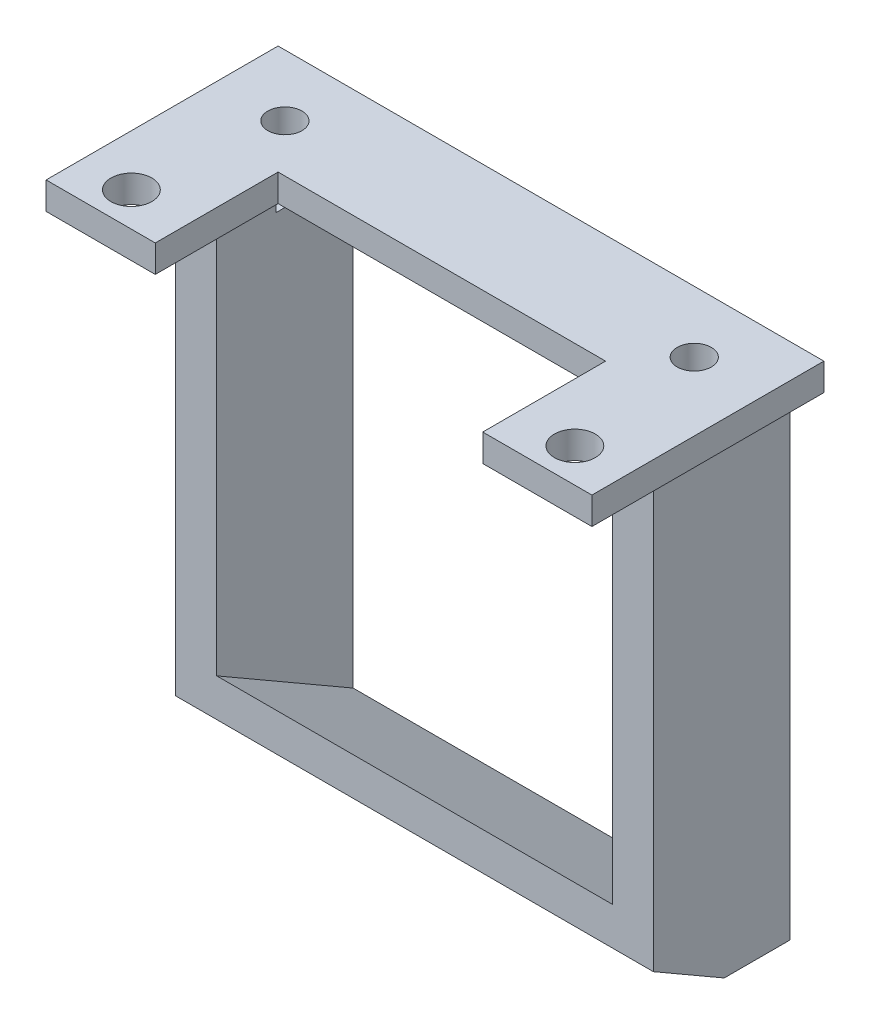
ISO-10303-21;
HEADER;
FILE_DESCRIPTION(('STEP AP214'),'2;1');
FILE_NAME('part.step','',(''),(''),'','','');
FILE_SCHEMA(('AUTOMOTIVE_DESIGN { 1 0 10303 214 1 1 1 1 }'));
ENDSEC;
DATA;
#1=APPLICATION_CONTEXT('core data for automotive mechanical design processes');
#2=APPLICATION_PROTOCOL_DEFINITION('international standard','automotive_design',2000,#1);
#3=PRODUCT_CONTEXT('',#1,'mechanical');
#4=PRODUCT('Part','Part','',(#3));
#5=PRODUCT_RELATED_PRODUCT_CATEGORY('part','',(#4));
#6=PRODUCT_DEFINITION_FORMATION('','',#4);
#7=PRODUCT_DEFINITION_CONTEXT('part definition',#1,'design');
#8=PRODUCT_DEFINITION('design','',#6,#7);
#9=PRODUCT_DEFINITION_SHAPE('','',#8);
#10=(LENGTH_UNIT() NAMED_UNIT(*) SI_UNIT(.MILLI.,.METRE.));
#11=(NAMED_UNIT(*) PLANE_ANGLE_UNIT() SI_UNIT($,.RADIAN.));
#12=(NAMED_UNIT(*) SI_UNIT($,.STERADIAN.) SOLID_ANGLE_UNIT());
#13=UNCERTAINTY_MEASURE_WITH_UNIT(LENGTH_MEASURE(1.E-05),#10,'distance_accuracy_value','');
#14=(GEOMETRIC_REPRESENTATION_CONTEXT(3) GLOBAL_UNCERTAINTY_ASSIGNED_CONTEXT((#13)) GLOBAL_UNIT_ASSIGNED_CONTEXT((#10,
#11,#12)) REPRESENTATION_CONTEXT('',''));
#15=CARTESIAN_POINT('',(0.,0.,0.));
#16=DIRECTION('',(0.,0.,1.));
#17=DIRECTION('',(1.,0.,0.));
#18=AXIS2_PLACEMENT_3D('',#15,#16,#17);
#19=CARTESIAN_POINT('',(0.,-2.,0.));
#20=DIRECTION('',(0.,1.,0.));
#21=DIRECTION('',(0.,0.,1.));
#22=AXIS2_PLACEMENT_3D('',#19,#20,#21);
#23=PLANE('',#22);
#24=CARTESIAN_POINT('',(-17.9639658488218,-2.,0.98592666671358));
#25=DIRECTION('',(0.,1.,0.));
#26=DIRECTION('',(0.,0.,1.));
#27=AXIS2_PLACEMENT_3D('',#24,#25,#26);
#28=CIRCLE('',#27,1.5);
#29=CARTESIAN_POINT('',(-17.9639658488218,-2.,2.48592666671358));
#30=VERTEX_POINT('',#29);
#31=EDGE_CURVE('E221',#30,#30,#28,.T.);
#32=ORIENTED_EDGE('',*,*,#31,.T.);
#33=EDGE_LOOP('',(#32));
#34=FACE_BOUND('',#33,.T.);
#35=CARTESIAN_POINT('',(14.5360341511782,-2.,0.985926666713577));
#36=DIRECTION('',(0.,1.,0.));
#37=DIRECTION('',(0.,0.,1.));
#38=AXIS2_PLACEMENT_3D('',#35,#36,#37);
#39=CIRCLE('',#38,1.5);
#40=CARTESIAN_POINT('',(14.5360341511782,-2.,2.48592666671358));
#41=VERTEX_POINT('',#40);
#42=EDGE_CURVE('E218',#41,#41,#39,.T.);
#43=ORIENTED_EDGE('',*,*,#42,.T.);
#44=EDGE_LOOP('',(#43));
#45=FACE_BOUND('',#44,.T.);
#46=DIRECTION('',(0.,0.,-1.));
#47=VECTOR('',#46,1.);
#48=CARTESIAN_POINT('',(12.7860341511782,-2.,-13.5140733332864));
#49=LINE('',#48,#47);
#50=CARTESIAN_POINT('',(12.7860341511782,-2.,-10.1597172570254));
#51=VERTEX_POINT('',#50);
#52=CARTESIAN_POINT('',(12.7860341511782,-2.,-13.5140733332864));
#53=VERTEX_POINT('',#52);
#54=EDGE_CURVE('E217',#51,#53,#49,.T.);
#55=ORIENTED_EDGE('',*,*,#54,.F.);
#56=CARTESIAN_POINT('',(13.2860341511782,-2.,-9.01407333328642));
#57=DIRECTION('',(0.,1.,0.));
#58=DIRECTION('',(0.,0.,1.));
#59=AXIS2_PLACEMENT_3D('',#56,#57,#58);
#60=CIRCLE('',#59,1.25);
#61=CARTESIAN_POINT('',(12.7860341511782,-2.,-7.86842940954746));
#62=VERTEX_POINT('',#61);
#63=EDGE_CURVE('E211',#51,#62,#60,.T.);
#64=ORIENTED_EDGE('',*,*,#63,.T.);
#65=CARTESIAN_POINT('',(12.7860341511782,-2.,-3.51407333328642));
#66=VERTEX_POINT('',#65);
#67=EDGE_CURVE('E207',#66,#62,#49,.T.);
#68=ORIENTED_EDGE('',*,*,#67,.F.);
#69=DIRECTION('',(-1.,0.,0.));
#70=VECTOR('',#69,1.);
#71=CARTESIAN_POINT('',(15.7860341511782,-2.,-3.51407333328642));
#72=LINE('',#71,#70);
#73=CARTESIAN_POINT('',(15.7860341511782,-2.,-3.51407333328642));
#74=VERTEX_POINT('',#73);
#75=EDGE_CURVE('E280',#74,#66,#72,.T.);
#76=ORIENTED_EDGE('',*,*,#75,.F.);
#77=DIRECTION('',(0.,0.,1.));
#78=VECTOR('',#77,1.);
#79=CARTESIAN_POINT('',(15.7860341511782,-2.,-13.5140733332864));
#80=LINE('',#79,#78);
#81=CARTESIAN_POINT('',(15.7860341511782,-2.,-13.5140733332864));
#82=VERTEX_POINT('',#81);
#83=EDGE_CURVE('E271',#82,#74,#80,.T.);
#84=ORIENTED_EDGE('',*,*,#83,.F.);
#85=DIRECTION('',(1.,0.,0.));
#86=VECTOR('',#85,1.);
#87=CARTESIAN_POINT('',(0.,-2.,-13.5140733332864));
#88=LINE('',#87,#86);
#89=CARTESIAN_POINT('',(18.2860341511782,-2.,-13.5140733332864));
#90=VERTEX_POINT('',#89);
#91=EDGE_CURVE('E307',#82,#90,#88,.T.);
#92=ORIENTED_EDGE('',*,*,#91,.T.);
#93=DIRECTION('',(0.,0.,1.));
#94=VECTOR('',#93,1.);
#95=CARTESIAN_POINT('',(18.2860341511782,-2.,0.));
#96=LINE('',#95,#94);
#97=CARTESIAN_POINT('',(18.2860341511782,-2.,3.48592666671358));
#98=VERTEX_POINT('',#97);
#99=EDGE_CURVE('E305',#90,#98,#96,.T.);
#100=ORIENTED_EDGE('',*,*,#99,.T.);
#101=DIRECTION('',(1.,0.,0.));
#102=VECTOR('',#101,1.);
#103=CARTESIAN_POINT('',(0.,-2.,3.48592666671358));
#104=LINE('',#103,#102);
#105=CARTESIAN_POINT('',(10.2860341511782,-2.,3.48592666671358));
#106=VERTEX_POINT('',#105);
#107=EDGE_CURVE('E302',#106,#98,#104,.T.);
#108=ORIENTED_EDGE('',*,*,#107,.F.);
#109=DIRECTION('',(0.,0.,1.));
#110=VECTOR('',#109,1.);
#111=CARTESIAN_POINT('',(10.2860341511782,-2.,0.));
#112=LINE('',#111,#110);
#113=CARTESIAN_POINT('',(10.2860341511782,-2.,-5.51407333328642));
#114=VERTEX_POINT('',#113);
#115=EDGE_CURVE('E299',#114,#106,#112,.T.);
#116=ORIENTED_EDGE('',*,*,#115,.F.);
#117=DIRECTION('',(1.,0.,0.));
#118=VECTOR('',#117,1.);
#119=CARTESIAN_POINT('',(0.,-2.,-5.51407333328642));
#120=LINE('',#119,#118);
#121=CARTESIAN_POINT('',(-13.7139658488218,-2.,-5.51407333328642));
#122=VERTEX_POINT('',#121);
#123=EDGE_CURVE('E295',#122,#114,#120,.T.);
#124=ORIENTED_EDGE('',*,*,#123,.F.);
#125=DIRECTION('',(0.,0.,1.));
#126=VECTOR('',#125,1.);
#127=CARTESIAN_POINT('',(-13.7139658488218,-2.,0.));
#128=LINE('',#127,#126);
#129=CARTESIAN_POINT('',(-13.7139658488218,-2.,3.48592666671358));
#130=VERTEX_POINT('',#129);
#131=EDGE_CURVE('E293',#122,#130,#128,.T.);
#132=ORIENTED_EDGE('',*,*,#131,.T.);
#133=DIRECTION('',(1.,0.,0.));
#134=VECTOR('',#133,1.);
#135=CARTESIAN_POINT('',(0.,-2.,3.48592666671358));
#136=LINE('',#135,#134);
#137=CARTESIAN_POINT('',(-21.7139658488218,-2.,3.48592666671358));
#138=VERTEX_POINT('',#137);
#139=EDGE_CURVE('E314',#138,#130,#136,.T.);
#140=ORIENTED_EDGE('',*,*,#139,.F.);
#141=DIRECTION('',(0.,0.,1.));
#142=VECTOR('',#141,1.);
#143=CARTESIAN_POINT('',(-21.7139658488218,-2.,0.));
#144=LINE('',#143,#142);
#145=CARTESIAN_POINT('',(-21.7139658488218,-2.,-13.5140733332864));
#146=VERTEX_POINT('',#145);
#147=EDGE_CURVE('E310',#146,#138,#144,.T.);
#148=ORIENTED_EDGE('',*,*,#147,.F.);
#149=CARTESIAN_POINT('',(-19.2139658488218,-2.,-13.5140733332864));
#150=VERTEX_POINT('',#149);
#151=EDGE_CURVE('E308',#146,#150,#88,.T.);
#152=ORIENTED_EDGE('',*,*,#151,.T.);
#153=DIRECTION('',(0.,0.,-1.));
#154=VECTOR('',#153,1.);
#155=CARTESIAN_POINT('',(-19.2139658488218,-2.,-13.5140733332864));
#156=LINE('',#155,#154);
#157=CARTESIAN_POINT('',(-19.2139658488218,-2.,-3.51407333328642));
#158=VERTEX_POINT('',#157);
#159=EDGE_CURVE('E252',#158,#150,#156,.T.);
#160=ORIENTED_EDGE('',*,*,#159,.F.);
#161=DIRECTION('',(-1.,0.,0.));
#162=VECTOR('',#161,1.);
#163=CARTESIAN_POINT('',(-16.2139658488218,-2.,-3.51407333328642));
#164=LINE('',#163,#162);
#165=CARTESIAN_POINT('',(-16.2139658488218,-2.,-3.51407333328642));
#166=VERTEX_POINT('',#165);
#167=EDGE_CURVE('E257',#166,#158,#164,.T.);
#168=ORIENTED_EDGE('',*,*,#167,.F.);
#169=DIRECTION('',(0.,0.,1.));
#170=VECTOR('',#169,1.);
#171=CARTESIAN_POINT('',(-16.2139658488218,-2.,-13.5140733332864));
#172=LINE('',#171,#170);
#173=CARTESIAN_POINT('',(-16.2139658488218,-2.,-7.86842940954746));
#174=VERTEX_POINT('',#173);
#175=EDGE_CURVE('E248',#174,#166,#172,.T.);
#176=ORIENTED_EDGE('',*,*,#175,.F.);
#177=CARTESIAN_POINT('',(-16.7139658488218,-2.,-9.01407333328642));
#178=DIRECTION('',(0.,1.,0.));
#179=DIRECTION('',(0.,0.,1.));
#180=AXIS2_PLACEMENT_3D('',#177,#178,#179);
#181=CIRCLE('',#180,1.25);
#182=CARTESIAN_POINT('',(-16.2139658488218,-2.,-10.1597172570254));
#183=VERTEX_POINT('',#182);
#184=EDGE_CURVE('E188',#174,#183,#181,.T.);
#185=ORIENTED_EDGE('',*,*,#184,.T.);
#186=CARTESIAN_POINT('',(-16.2139658488218,-2.,-13.5140733332864));
#187=VERTEX_POINT('',#186);
#188=EDGE_CURVE('E195',#187,#183,#172,.T.);
#189=ORIENTED_EDGE('',*,*,#188,.F.);
#190=EDGE_CURVE('E311',#187,#53,#88,.T.);
#191=ORIENTED_EDGE('',*,*,#190,.T.);
#192=EDGE_LOOP('',(#55,#64,#68,#76,#84,#92,#100,#108,#116,#124,#132,#140,#148,#152,#160,#168,
#176,#185,#189,#191));
#193=FACE_BOUND('',#192,.T.);
#194=ADVANCED_FACE('F35',(#34,#45,#193),#23,.F.);
#195=CARTESIAN_POINT('',(-13.7139658488218,-2.,0.));
#196=DIRECTION('',(-1.,0.,0.));
#197=DIRECTION('',(0.,0.,1.));
#198=AXIS2_PLACEMENT_3D('',#195,#196,#197);
#199=PLANE('',#198);
#200=DIRECTION('',(0.,0.,1.));
#201=VECTOR('',#200,1.);
#202=CARTESIAN_POINT('',(-13.7139658488218,0.,0.));
#203=LINE('',#202,#201);
#204=CARTESIAN_POINT('',(-13.7139658488218,0.,-5.51407333328642));
#205=VERTEX_POINT('',#204);
#206=CARTESIAN_POINT('',(-13.7139658488218,0.,3.48592666671358));
#207=VERTEX_POINT('',#206);
#208=EDGE_CURVE('E292',#205,#207,#203,.T.);
#209=ORIENTED_EDGE('',*,*,#208,.T.);
#210=DIRECTION('',(0.,1.,0.));
#211=VECTOR('',#210,1.);
#212=CARTESIAN_POINT('',(-13.7139658488218,-2.,3.48592666671358));
#213=LINE('',#212,#211);
#214=EDGE_CURVE('E182',#130,#207,#213,.T.);
#215=ORIENTED_EDGE('',*,*,#214,.F.);
#216=ORIENTED_EDGE('',*,*,#131,.F.);
#217=DIRECTION('',(0.,1.,0.));
#218=VECTOR('',#217,1.);
#219=CARTESIAN_POINT('',(-13.7139658488218,-2.,-5.51407333328642));
#220=LINE('',#219,#218);
#221=EDGE_CURVE('E317',#122,#205,#220,.T.);
#222=ORIENTED_EDGE('',*,*,#221,.T.);
#223=EDGE_LOOP('',(#209,#215,#216,#222));
#224=FACE_BOUND('',#223,.T.);
#225=ADVANCED_FACE('F37',(#224),#199,.F.);
#226=CARTESIAN_POINT('',(0.,-2.,3.48592666671358));
#227=DIRECTION('',(0.,0.,1.));
#228=DIRECTION('',(1.,0.,0.));
#229=AXIS2_PLACEMENT_3D('',#226,#227,#228);
#230=PLANE('',#229);
#231=DIRECTION('',(1.,0.,0.));
#232=VECTOR('',#231,1.);
#233=CARTESIAN_POINT('',(0.,0.,3.48592666671358));
#234=LINE('',#233,#232);
#235=CARTESIAN_POINT('',(-21.7139658488218,0.,3.48592666671358));
#236=VERTEX_POINT('',#235);
#237=EDGE_CURVE('E296',#236,#207,#234,.T.);
#238=ORIENTED_EDGE('',*,*,#237,.F.);
#239=DIRECTION('',(0.,1.,0.));
#240=VECTOR('',#239,1.);
#241=CARTESIAN_POINT('',(-21.7139658488218,-2.,3.48592666671358));
#242=LINE('',#241,#240);
#243=EDGE_CURVE('E340',#138,#236,#242,.T.);
#244=ORIENTED_EDGE('',*,*,#243,.F.);
#245=ORIENTED_EDGE('',*,*,#139,.T.);
#246=ORIENTED_EDGE('',*,*,#214,.T.);
#247=EDGE_LOOP('',(#238,#244,#245,#246));
#248=FACE_BOUND('',#247,.T.);
#249=ADVANCED_FACE('F389',(#248),#230,.T.);
#250=CARTESIAN_POINT('',(-21.7139658488218,-2.,0.));
#251=DIRECTION('',(-1.,0.,0.));
#252=DIRECTION('',(0.,0.,1.));
#253=AXIS2_PLACEMENT_3D('',#250,#251,#252);
#254=PLANE('',#253);
#255=DIRECTION('',(0.,0.,1.));
#256=VECTOR('',#255,1.);
#257=CARTESIAN_POINT('',(-21.7139658488218,0.,0.));
#258=LINE('',#257,#256);
#259=CARTESIAN_POINT('',(-21.7139658488218,0.,-13.5140733332864));
#260=VERTEX_POINT('',#259);
#261=EDGE_CURVE('E334',#260,#236,#258,.T.);
#262=ORIENTED_EDGE('',*,*,#261,.F.);
#263=DIRECTION('',(0.,1.,0.));
#264=VECTOR('',#263,1.);
#265=CARTESIAN_POINT('',(-21.7139658488218,-2.,-13.5140733332864));
#266=LINE('',#265,#264);
#267=EDGE_CURVE('E342',#146,#260,#266,.T.);
#268=ORIENTED_EDGE('',*,*,#267,.F.);
#269=ORIENTED_EDGE('',*,*,#147,.T.);
#270=ORIENTED_EDGE('',*,*,#243,.T.);
#271=EDGE_LOOP('',(#262,#268,#269,#270));
#272=FACE_BOUND('',#271,.T.);
#273=ADVANCED_FACE('F385',(#272),#254,.T.);
#274=CARTESIAN_POINT('',(0.,-2.,-13.5140733332864));
#275=DIRECTION('',(0.,0.,1.));
#276=DIRECTION('',(1.,0.,0.));
#277=AXIS2_PLACEMENT_3D('',#274,#275,#276);
#278=PLANE('',#277);
#279=DIRECTION('',(1.,0.,0.));
#280=VECTOR('',#279,1.);
#281=CARTESIAN_POINT('',(0.,0.,-13.5140733332864));
#282=LINE('',#281,#280);
#283=CARTESIAN_POINT('',(18.2860341511782,0.,-13.5140733332864));
#284=VERTEX_POINT('',#283);
#285=EDGE_CURVE('E332',#260,#284,#282,.T.);
#286=ORIENTED_EDGE('',*,*,#285,.T.);
#287=DIRECTION('',(0.,1.,0.));
#288=VECTOR('',#287,1.);
#289=CARTESIAN_POINT('',(18.2860341511782,-2.,-13.5140733332864));
#290=LINE('',#289,#288);
#291=EDGE_CURVE('E344',#90,#284,#290,.T.);
#292=ORIENTED_EDGE('',*,*,#291,.F.);
#293=ORIENTED_EDGE('',*,*,#91,.F.);
#294=DIRECTION('',(0.,1.,0.));
#295=VECTOR('',#294,1.);
#296=CARTESIAN_POINT('',(15.7860341511782,-38.,-13.5140733332864));
#297=LINE('',#296,#295);
#298=CARTESIAN_POINT('',(15.7860341511782,-38.,-13.5140733332864));
#299=VERTEX_POINT('',#298);
#300=EDGE_CURVE('E277',#299,#82,#297,.T.);
#301=ORIENTED_EDGE('',*,*,#300,.F.);
#302=DIRECTION('',(1.,0.,0.));
#303=VECTOR('',#302,1.);
#304=CARTESIAN_POINT('',(15.7860341511782,-38.,-13.5140733332864));
#305=LINE('',#304,#303);
#306=CARTESIAN_POINT('',(12.7860341511782,-38.,-13.5140733332864));
#307=VERTEX_POINT('',#306);
#308=EDGE_CURVE('E275',#307,#299,#305,.T.);
#309=ORIENTED_EDGE('',*,*,#308,.F.);
#310=DIRECTION('',(0.,1.,0.));
#311=VECTOR('',#310,1.);
#312=CARTESIAN_POINT('',(12.7860341511782,-38.,-13.5140733332864));
#313=LINE('',#312,#311);
#314=EDGE_CURVE('E285',#307,#53,#313,.T.);
#315=ORIENTED_EDGE('',*,*,#314,.T.);
#316=ORIENTED_EDGE('',*,*,#190,.F.);
#317=DIRECTION('',(0.,1.,0.));
#318=VECTOR('',#317,1.);
#319=CARTESIAN_POINT('',(-16.2139658488218,-38.,-13.5140733332864));
#320=LINE('',#319,#318);
#321=CARTESIAN_POINT('',(-16.2139658488059,-38.,-13.5140733332864));
#322=VERTEX_POINT('',#321);
#323=EDGE_CURVE('E255',#322,#187,#320,.T.);
#324=ORIENTED_EDGE('',*,*,#323,.F.);
#325=DIRECTION('',(1.,0.,0.));
#326=VECTOR('',#325,1.);
#327=CARTESIAN_POINT('',(-16.2139658488218,-38.,-13.5140733332864));
#328=LINE('',#327,#326);
#329=CARTESIAN_POINT('',(-19.2139658488218,-38.,-13.5140733332864));
#330=VERTEX_POINT('',#329);
#331=EDGE_CURVE('E251',#330,#322,#328,.T.);
#332=ORIENTED_EDGE('',*,*,#331,.F.);
#333=DIRECTION('',(0.,1.,0.));
#334=VECTOR('',#333,1.);
#335=CARTESIAN_POINT('',(-19.2139658488218,-38.,-13.5140733332864));
#336=LINE('',#335,#334);
#337=EDGE_CURVE('E263',#330,#150,#336,.T.);
#338=ORIENTED_EDGE('',*,*,#337,.T.);
#339=ORIENTED_EDGE('',*,*,#151,.F.);
#340=ORIENTED_EDGE('',*,*,#267,.T.);
#341=EDGE_LOOP('',(#286,#292,#293,#301,#309,#315,#316,#324,#332,#338,#339,#340));
#342=FACE_BOUND('',#341,.T.);
#343=ADVANCED_FACE('F380',(#342),#278,.F.);
#344=CARTESIAN_POINT('',(18.2860341511782,-2.,0.));
#345=DIRECTION('',(-1.,0.,0.));
#346=DIRECTION('',(0.,0.,1.));
#347=AXIS2_PLACEMENT_3D('',#344,#345,#346);
#348=PLANE('',#347);
#349=DIRECTION('',(0.,0.,1.));
#350=VECTOR('',#349,1.);
#351=CARTESIAN_POINT('',(18.2860341511782,0.,0.));
#352=LINE('',#351,#350);
#353=CARTESIAN_POINT('',(18.2860341511782,0.,3.48592666671358));
#354=VERTEX_POINT('',#353);
#355=EDGE_CURVE('E329',#284,#354,#352,.T.);
#356=ORIENTED_EDGE('',*,*,#355,.T.);
#357=DIRECTION('',(0.,1.,0.));
#358=VECTOR('',#357,1.);
#359=CARTESIAN_POINT('',(18.2860341511782,-2.,3.48592666671358));
#360=LINE('',#359,#358);
#361=EDGE_CURVE('E347',#98,#354,#360,.T.);
#362=ORIENTED_EDGE('',*,*,#361,.F.);
#363=ORIENTED_EDGE('',*,*,#99,.F.);
#364=ORIENTED_EDGE('',*,*,#291,.T.);
#365=EDGE_LOOP('',(#356,#362,#363,#364));
#366=FACE_BOUND('',#365,.T.);
#367=ADVANCED_FACE('F376',(#366),#348,.F.);
#368=CARTESIAN_POINT('',(0.,-2.,3.48592666671358));
#369=DIRECTION('',(0.,0.,1.));
#370=DIRECTION('',(1.,0.,0.));
#371=AXIS2_PLACEMENT_3D('',#368,#369,#370);
#372=PLANE('',#371);
#373=DIRECTION('',(1.,0.,0.));
#374=VECTOR('',#373,1.);
#375=CARTESIAN_POINT('',(0.,0.,3.48592666671358));
#376=LINE('',#375,#374);
#377=CARTESIAN_POINT('',(10.2860341511782,0.,3.48592666671358));
#378=VERTEX_POINT('',#377);
#379=EDGE_CURVE('E326',#378,#354,#376,.T.);
#380=ORIENTED_EDGE('',*,*,#379,.F.);
#381=DIRECTION('',(0.,1.,0.));
#382=VECTOR('',#381,1.);
#383=CARTESIAN_POINT('',(10.2860341511782,-2.,3.48592666671358));
#384=LINE('',#383,#382);
#385=EDGE_CURVE('E349',#106,#378,#384,.T.);
#386=ORIENTED_EDGE('',*,*,#385,.F.);
#387=ORIENTED_EDGE('',*,*,#107,.T.);
#388=ORIENTED_EDGE('',*,*,#361,.T.);
#389=EDGE_LOOP('',(#380,#386,#387,#388));
#390=FACE_BOUND('',#389,.T.);
#391=ADVANCED_FACE('F371',(#390),#372,.T.);
#392=CARTESIAN_POINT('',(10.2860341511782,-2.,0.));
#393=DIRECTION('',(-1.,0.,0.));
#394=DIRECTION('',(0.,0.,1.));
#395=AXIS2_PLACEMENT_3D('',#392,#393,#394);
#396=PLANE('',#395);
#397=DIRECTION('',(0.,0.,1.));
#398=VECTOR('',#397,1.);
#399=CARTESIAN_POINT('',(10.2860341511782,0.,0.));
#400=LINE('',#399,#398);
#401=CARTESIAN_POINT('',(10.2860341511782,0.,-5.51407333328642));
#402=VERTEX_POINT('',#401);
#403=EDGE_CURVE('E323',#402,#378,#400,.T.);
#404=ORIENTED_EDGE('',*,*,#403,.F.);
#405=DIRECTION('',(0.,1.,0.));
#406=VECTOR('',#405,1.);
#407=CARTESIAN_POINT('',(10.2860341511782,-2.,-5.51407333328642));
#408=LINE('',#407,#406);
#409=EDGE_CURVE('E351',#114,#402,#408,.T.);
#410=ORIENTED_EDGE('',*,*,#409,.F.);
#411=ORIENTED_EDGE('',*,*,#115,.T.);
#412=ORIENTED_EDGE('',*,*,#385,.T.);
#413=EDGE_LOOP('',(#404,#410,#411,#412));
#414=FACE_BOUND('',#413,.T.);
#415=ADVANCED_FACE('F366',(#414),#396,.T.);
#416=CARTESIAN_POINT('',(0.,-2.,-5.51407333328642));
#417=DIRECTION('',(0.,0.,1.));
#418=DIRECTION('',(1.,0.,0.));
#419=AXIS2_PLACEMENT_3D('',#416,#417,#418);
#420=PLANE('',#419);
#421=DIRECTION('',(1.,0.,0.));
#422=VECTOR('',#421,1.);
#423=CARTESIAN_POINT('',(0.,0.,-5.51407333328642));
#424=LINE('',#423,#422);
#425=EDGE_CURVE('E320',#205,#402,#424,.T.);
#426=ORIENTED_EDGE('',*,*,#425,.F.);
#427=ORIENTED_EDGE('',*,*,#221,.F.);
#428=ORIENTED_EDGE('',*,*,#123,.T.);
#429=ORIENTED_EDGE('',*,*,#409,.T.);
#430=EDGE_LOOP('',(#426,#427,#428,#429));
#431=FACE_BOUND('',#430,.T.);
#432=ADVANCED_FACE('F362',(#431),#420,.T.);
#433=CARTESIAN_POINT('',(0.,0.,0.));
#434=DIRECTION('',(0.,1.,0.));
#435=DIRECTION('',(0.,0.,1.));
#436=AXIS2_PLACEMENT_3D('',#433,#434,#435);
#437=PLANE('',#436);
#438=CARTESIAN_POINT('',(13.2860341511782,0.,-9.01407333328642));
#439=DIRECTION('',(0.,1.,0.));
#440=DIRECTION('',(0.,0.,1.));
#441=AXIS2_PLACEMENT_3D('',#438,#439,#440);
#442=CIRCLE('',#441,1.25);
#443=CARTESIAN_POINT('',(13.2860341511782,0.,-7.76407333328643));
#444=VERTEX_POINT('',#443);
#445=EDGE_CURVE('E668',#444,#444,#442,.T.);
#446=ORIENTED_EDGE('',*,*,#445,.F.);
#447=EDGE_LOOP('',(#446));
#448=FACE_BOUND('',#447,.T.);
#449=CARTESIAN_POINT('',(-17.9639658488218,0.,0.98592666671358));
#450=DIRECTION('',(0.,1.,0.));
#451=DIRECTION('',(0.,0.,1.));
#452=AXIS2_PLACEMENT_3D('',#449,#450,#451);
#453=CIRCLE('',#452,1.5);
#454=CARTESIAN_POINT('',(-17.9639658488218,0.,2.48592666671358));
#455=VERTEX_POINT('',#454);
#456=EDGE_CURVE('E665',#455,#455,#453,.T.);
#457=ORIENTED_EDGE('',*,*,#456,.F.);
#458=EDGE_LOOP('',(#457));
#459=FACE_BOUND('',#458,.T.);
#460=CARTESIAN_POINT('',(14.5360341511782,0.,0.985926666713577));
#461=DIRECTION('',(0.,1.,0.));
#462=DIRECTION('',(0.,0.,1.));
#463=AXIS2_PLACEMENT_3D('',#460,#461,#462);
#464=CIRCLE('',#463,1.5);
#465=CARTESIAN_POINT('',(14.5360341511782,0.,2.48592666671358));
#466=VERTEX_POINT('',#465);
#467=EDGE_CURVE('E669',#466,#466,#464,.T.);
#468=ORIENTED_EDGE('',*,*,#467,.F.);
#469=EDGE_LOOP('',(#468));
#470=FACE_BOUND('',#469,.T.);
#471=CARTESIAN_POINT('',(-16.7139658488218,0.,-9.01407333328642));
#472=DIRECTION('',(0.,1.,0.));
#473=DIRECTION('',(0.,0.,1.));
#474=AXIS2_PLACEMENT_3D('',#471,#472,#473);
#475=CIRCLE('',#474,1.25);
#476=CARTESIAN_POINT('',(-16.7139658488218,0.,-7.76407333328642));
#477=VERTEX_POINT('',#476);
#478=EDGE_CURVE('E189',#477,#477,#475,.T.);
#479=ORIENTED_EDGE('',*,*,#478,.F.);
#480=EDGE_LOOP('',(#479));
#481=FACE_BOUND('',#480,.T.);
#482=ORIENTED_EDGE('',*,*,#208,.F.);
#483=ORIENTED_EDGE('',*,*,#425,.T.);
#484=ORIENTED_EDGE('',*,*,#403,.T.);
#485=ORIENTED_EDGE('',*,*,#379,.T.);
#486=ORIENTED_EDGE('',*,*,#355,.F.);
#487=ORIENTED_EDGE('',*,*,#285,.F.);
#488=ORIENTED_EDGE('',*,*,#261,.T.);
#489=ORIENTED_EDGE('',*,*,#237,.T.);
#490=EDGE_LOOP('',(#482,#483,#484,#485,#486,#487,#488,#489));
#491=FACE_BOUND('',#490,.T.);
#492=ADVANCED_FACE('F360',(#448,#459,#470,#481,#491),#437,.T.);
#493=CARTESIAN_POINT('',(15.7860341511782,-38.,-13.5140733332864));
#494=DIRECTION('',(-1.,0.,0.));
#495=DIRECTION('',(0.,0.,1.));
#496=AXIS2_PLACEMENT_3D('',#493,#494,#495);
#497=PLANE('',#496);
#498=DIRECTION('',(0.,1.,0.));
#499=VECTOR('',#498,1.);
#500=CARTESIAN_POINT('',(15.7860341511782,-38.,-3.51407333328642));
#501=LINE('',#500,#499);
#502=CARTESIAN_POINT('',(15.7860341511782,-35.,-3.51407333328641));
#503=VERTEX_POINT('',#502);
#504=EDGE_CURVE('E290',#503,#74,#501,.T.);
#505=ORIENTED_EDGE('',*,*,#504,.F.);
#506=DIRECTION('',(0.,-0.500000000000001,-0.866025403784438));
#507=VECTOR('',#506,1.);
#508=CARTESIAN_POINT('',(15.7860341511782,-40.0801270189222,-12.3131114389631));
#509=LINE('',#508,#507);
#510=CARTESIAN_POINT('',(15.7860341511782,-38.,-8.71022575599303));
#511=VERTEX_POINT('',#510);
#512=EDGE_CURVE('E234',#503,#511,#509,.T.);
#513=ORIENTED_EDGE('',*,*,#512,.T.);
#514=DIRECTION('',(0.,0.,1.));
#515=VECTOR('',#514,1.);
#516=CARTESIAN_POINT('',(15.7860341511782,-38.,-13.5140733332864));
#517=LINE('',#516,#515);
#518=EDGE_CURVE('E272',#299,#511,#517,.T.);
#519=ORIENTED_EDGE('',*,*,#518,.F.);
#520=ORIENTED_EDGE('',*,*,#300,.T.);
#521=ORIENTED_EDGE('',*,*,#83,.T.);
#522=EDGE_LOOP('',(#505,#513,#519,#520,#521));
#523=FACE_BOUND('',#522,.T.);
#524=ADVANCED_FACE('F403',(#523),#497,.F.);
#525=CARTESIAN_POINT('',(15.7860341511782,-38.,-3.51407333328642));
#526=DIRECTION('',(0.,0.,-1.));
#527=DIRECTION('',(-1.,0.,0.));
#528=AXIS2_PLACEMENT_3D('',#525,#526,#527);
#529=PLANE('',#528);
#530=DIRECTION('',(0.,1.,0.));
#531=VECTOR('',#530,1.);
#532=CARTESIAN_POINT('',(-19.2139658488218,-38.,-3.51407333328642));
#533=LINE('',#532,#531);
#534=CARTESIAN_POINT('',(-19.2139658488218,-35.,-3.51407333328642));
#535=VERTEX_POINT('',#534);
#536=EDGE_CURVE('E266',#535,#158,#533,.T.);
#537=ORIENTED_EDGE('',*,*,#536,.F.);
#538=DIRECTION('',(-1.,0.,0.));
#539=VECTOR('',#538,1.);
#540=CARTESIAN_POINT('',(18.2860341511782,-35.,-3.51407333328641));
#541=LINE('',#540,#539);
#542=EDGE_CURVE('E230',#503,#535,#541,.T.);
#543=ORIENTED_EDGE('',*,*,#542,.F.);
#544=ORIENTED_EDGE('',*,*,#504,.T.);
#545=ORIENTED_EDGE('',*,*,#75,.T.);
#546=DIRECTION('',(0.,1.,0.));
#547=VECTOR('',#546,1.);
#548=CARTESIAN_POINT('',(12.7860341511782,-38.,-3.51407333328642));
#549=LINE('',#548,#547);
#550=CARTESIAN_POINT('',(12.7860341511782,-32.2264973081038,-3.51407333328642));
#551=VERTEX_POINT('',#550);
#552=EDGE_CURVE('E288',#551,#66,#549,.T.);
#553=ORIENTED_EDGE('',*,*,#552,.F.);
#554=DIRECTION('',(1.,0.,0.));
#555=VECTOR('',#554,1.);
#556=CARTESIAN_POINT('',(-500000.,-32.2264973081038,-3.51407333328642));
#557=LINE('',#556,#555);
#558=CARTESIAN_POINT('',(-16.2139658488059,-32.2264973081038,-3.51407333328642));
#559=VERTEX_POINT('',#558);
#560=EDGE_CURVE('E244',#559,#551,#557,.T.);
#561=ORIENTED_EDGE('',*,*,#560,.F.);
#562=DIRECTION('',(0.,1.,0.));
#563=VECTOR('',#562,1.);
#564=CARTESIAN_POINT('',(-16.2139658488218,-38.,-3.51407333328642));
#565=LINE('',#564,#563);
#566=EDGE_CURVE('E268',#559,#166,#565,.T.);
#567=ORIENTED_EDGE('',*,*,#566,.T.);
#568=ORIENTED_EDGE('',*,*,#167,.T.);
#569=EDGE_LOOP('',(#537,#543,#544,#545,#553,#561,#567,#568));
#570=FACE_BOUND('',#569,.T.);
#571=ADVANCED_FACE('F398',(#570),#529,.F.);
#572=CARTESIAN_POINT('',(12.7860341511782,-38.,-13.5140733332864));
#573=DIRECTION('',(1.,0.,0.));
#574=DIRECTION('',(0.,0.,-1.));
#575=AXIS2_PLACEMENT_3D('',#572,#573,#574);
#576=PLANE('',#575);
#577=DIRECTION('',(0.,0.,1.));
#578=VECTOR('',#577,1.);
#579=CARTESIAN_POINT('',(12.7860341511782,-5.,-13.5140733332864));
#580=LINE('',#579,#578);
#581=CARTESIAN_POINT('',(12.7860341511782,-5.,-10.1597172570254));
#582=VERTEX_POINT('',#581);
#583=CARTESIAN_POINT('',(12.7860341511782,-5.,-7.86842940954746));
#584=VERTEX_POINT('',#583);
#585=EDGE_CURVE('E197',#582,#584,#580,.T.);
#586=ORIENTED_EDGE('',*,*,#585,.F.);
#587=DIRECTION('',(0.,1.,0.));
#588=VECTOR('',#587,1.);
#589=CARTESIAN_POINT('',(12.7860341511782,-5.,-10.1597172570254));
#590=LINE('',#589,#588);
#591=EDGE_CURVE('E11',#582,#51,#590,.T.);
#592=ORIENTED_EDGE('',*,*,#591,.T.);
#593=ORIENTED_EDGE('',*,*,#54,.T.);
#594=ORIENTED_EDGE('',*,*,#314,.F.);
#595=DIRECTION('',(0.,0.499999999999995,0.866025403784442));
#596=VECTOR('',#595,1.);
#597=CARTESIAN_POINT('',(12.7860341511782,-38.,-13.5140733332864));
#598=LINE('',#597,#596);
#599=EDGE_CURVE('E238',#307,#551,#598,.T.);
#600=ORIENTED_EDGE('',*,*,#599,.T.);
#601=ORIENTED_EDGE('',*,*,#552,.T.);
#602=ORIENTED_EDGE('',*,*,#67,.T.);
#603=DIRECTION('',(0.,1.,0.));
#604=VECTOR('',#603,1.);
#605=CARTESIAN_POINT('',(12.7860341511782,-5.,-7.86842940954746));
#606=LINE('',#605,#604);
#607=EDGE_CURVE('E43',#62,#584,#606,.F.);
#608=ORIENTED_EDGE('',*,*,#607,.T.);
#609=EDGE_LOOP('',(#586,#592,#593,#594,#600,#601,#602,#608));
#610=FACE_BOUND('',#609,.T.);
#611=ADVANCED_FACE('F205',(#610),#576,.F.);
#612=CARTESIAN_POINT('',(0.,-38.,0.));
#613=DIRECTION('',(0.,-1.,0.));
#614=DIRECTION('',(0.,0.,-1.));
#615=AXIS2_PLACEMENT_3D('',#612,#613,#614);
#616=PLANE('',#615);
#617=DIRECTION('',(-1.,0.,0.));
#618=VECTOR('',#617,1.);
#619=CARTESIAN_POINT('',(18.2860341511782,-38.,-8.71022575599303));
#620=LINE('',#619,#618);
#621=CARTESIAN_POINT('',(-19.2139658488218,-38.,-8.71022575599304));
#622=VERTEX_POINT('',#621);
#623=EDGE_CURVE('E231',#511,#622,#620,.T.);
#624=ORIENTED_EDGE('',*,*,#623,.T.);
#625=DIRECTION('',(0.,0.,-1.));
#626=VECTOR('',#625,1.);
#627=CARTESIAN_POINT('',(-19.2139658488218,-38.,-13.5140733332864));
#628=LINE('',#627,#626);
#629=EDGE_CURVE('E249',#622,#330,#628,.T.);
#630=ORIENTED_EDGE('',*,*,#629,.T.);
#631=ORIENTED_EDGE('',*,*,#331,.T.);
#632=DIRECTION('',(1.,0.,0.));
#633=VECTOR('',#632,1.);
#634=CARTESIAN_POINT('',(-500000.,-38.,-13.5140733332864));
#635=LINE('',#634,#633);
#636=EDGE_CURVE('E241',#322,#307,#635,.T.);
#637=ORIENTED_EDGE('',*,*,#636,.T.);
#638=ORIENTED_EDGE('',*,*,#308,.T.);
#639=ORIENTED_EDGE('',*,*,#518,.T.);
#640=EDGE_LOOP('',(#624,#630,#631,#637,#638,#639));
#641=FACE_BOUND('',#640,.T.);
#642=ADVANCED_FACE('F406',(#641),#616,.T.);
#643=CARTESIAN_POINT('',(-16.2139658488218,-38.,-13.5140733332864));
#644=DIRECTION('',(-1.,0.,0.));
#645=DIRECTION('',(0.,0.,1.));
#646=AXIS2_PLACEMENT_3D('',#643,#644,#645);
#647=PLANE('',#646);
#648=DIRECTION('',(0.,0.,-1.));
#649=VECTOR('',#648,1.);
#650=CARTESIAN_POINT('',(-16.2139658488218,-5.,-13.5140733332864));
#651=LINE('',#650,#649);
#652=CARTESIAN_POINT('',(-16.2139658488218,-5.,-7.86842940954746));
#653=VERTEX_POINT('',#652);
#654=CARTESIAN_POINT('',(-16.2139658488218,-5.,-10.1597172570254));
#655=VERTEX_POINT('',#654);
#656=EDGE_CURVE('E176',#653,#655,#651,.T.);
#657=ORIENTED_EDGE('',*,*,#656,.F.);
#658=DIRECTION('',(0.,1.,0.));
#659=VECTOR('',#658,1.);
#660=CARTESIAN_POINT('',(-16.2139658488218,-5.,-7.86842940954746));
#661=LINE('',#660,#659);
#662=EDGE_CURVE('E187',#653,#174,#661,.T.);
#663=ORIENTED_EDGE('',*,*,#662,.T.);
#664=ORIENTED_EDGE('',*,*,#175,.T.);
#665=ORIENTED_EDGE('',*,*,#566,.F.);
#666=DIRECTION('',(0.,0.499999999999995,0.866025403784442));
#667=VECTOR('',#666,1.);
#668=CARTESIAN_POINT('',(-16.2139658488059,-38.,-13.5140733332864));
#669=LINE('',#668,#667);
#670=EDGE_CURVE('E246',#322,#559,#669,.T.);
#671=ORIENTED_EDGE('',*,*,#670,.F.);
#672=ORIENTED_EDGE('',*,*,#323,.T.);
#673=ORIENTED_EDGE('',*,*,#188,.T.);
#674=DIRECTION('',(0.,1.,0.));
#675=VECTOR('',#674,1.);
#676=CARTESIAN_POINT('',(-16.2139658488218,-5.,-10.1597172570254));
#677=LINE('',#676,#675);
#678=EDGE_CURVE('E181',#183,#655,#677,.F.);
#679=ORIENTED_EDGE('',*,*,#678,.T.);
#680=EDGE_LOOP('',(#657,#663,#664,#665,#671,#672,#673,#679));
#681=FACE_BOUND('',#680,.T.);
#682=ADVANCED_FACE('F192',(#681),#647,.F.);
#683=CARTESIAN_POINT('',(-19.2139658488218,-38.,-13.5140733332864));
#684=DIRECTION('',(1.,0.,0.));
#685=DIRECTION('',(0.,0.,-1.));
#686=AXIS2_PLACEMENT_3D('',#683,#684,#685);
#687=PLANE('',#686);
#688=ORIENTED_EDGE('',*,*,#629,.F.);
#689=DIRECTION('',(0.,-0.500000000000001,-0.866025403784438));
#690=VECTOR('',#689,1.);
#691=CARTESIAN_POINT('',(-19.2139658488218,-35.,-3.51407333328642));
#692=LINE('',#691,#690);
#693=EDGE_CURVE('E228',#535,#622,#692,.T.);
#694=ORIENTED_EDGE('',*,*,#693,.F.);
#695=ORIENTED_EDGE('',*,*,#536,.T.);
#696=ORIENTED_EDGE('',*,*,#159,.T.);
#697=ORIENTED_EDGE('',*,*,#337,.F.);
#698=EDGE_LOOP('',(#688,#694,#695,#696,#697));
#699=FACE_BOUND('',#698,.T.);
#700=ADVANCED_FACE('F416',(#699),#687,.F.);
#701=CARTESIAN_POINT('',(-500000.,-38.,-13.5140733332864));
#702=DIRECTION('',(0.,0.866025403784441,-0.499999999999995));
#703=DIRECTION('',(0.,0.499999999999995,0.866025403784442));
#704=AXIS2_PLACEMENT_3D('',#701,#702,#703);
#705=PLANE('',#704);
#706=ORIENTED_EDGE('',*,*,#636,.F.);
#707=ORIENTED_EDGE('',*,*,#670,.T.);
#708=ORIENTED_EDGE('',*,*,#560,.T.);
#709=ORIENTED_EDGE('',*,*,#599,.F.);
#710=EDGE_LOOP('',(#706,#707,#708,#709));
#711=FACE_BOUND('',#710,.T.);
#712=ADVANCED_FACE('F410',(#711),#705,.T.);
#713=CARTESIAN_POINT('',(18.2860341511782,-35.,-3.51407333328641));
#714=DIRECTION('',(0.,0.866025403784438,-0.500000000000001));
#715=DIRECTION('',(0.,0.500000000000001,0.866025403784438));
#716=AXIS2_PLACEMENT_3D('',#713,#714,#715);
#717=PLANE('',#716);
#718=ORIENTED_EDGE('',*,*,#542,.T.);
#719=ORIENTED_EDGE('',*,*,#693,.T.);
#720=ORIENTED_EDGE('',*,*,#623,.F.);
#721=ORIENTED_EDGE('',*,*,#512,.F.);
#722=EDGE_LOOP('',(#718,#719,#720,#721));
#723=FACE_BOUND('',#722,.T.);
#724=ADVANCED_FACE('F419',(#723),#717,.F.);
#725=CARTESIAN_POINT('',(-16.7139658488218,-5.,-9.01407333328642));
#726=DIRECTION('',(0.,1.,0.));
#727=DIRECTION('',(0.,0.,1.));
#728=AXIS2_PLACEMENT_3D('',#725,#726,#727);
#729=CYLINDRICAL_SURFACE('',#728,1.25);
#730=ORIENTED_EDGE('',*,*,#478,.T.);
#731=EDGE_LOOP('',(#730));
#732=FACE_BOUND('',#731,.T.);
#733=CARTESIAN_POINT('',(-16.7139658488218,-5.,-9.01407333328642));
#734=DIRECTION('',(0.,1.,0.));
#735=DIRECTION('',(0.,0.,1.));
#736=AXIS2_PLACEMENT_3D('',#733,#734,#735);
#737=CIRCLE('',#736,1.25);
#738=EDGE_CURVE('E56',#655,#653,#737,.T.);
#739=ORIENTED_EDGE('',*,*,#738,.F.);
#740=ORIENTED_EDGE('',*,*,#678,.F.);
#741=ORIENTED_EDGE('',*,*,#184,.F.);
#742=ORIENTED_EDGE('',*,*,#662,.F.);
#743=EDGE_LOOP('',(#739,#740,#741,#742));
#744=FACE_BOUND('',#743,.T.);
#745=ADVANCED_FACE('F185',(#732,#744),#729,.F.);
#746=CARTESIAN_POINT('',(-16.7139658488218,-5.,-9.01407333328642));
#747=DIRECTION('',(0.,1.,0.));
#748=DIRECTION('',(0.,0.,1.));
#749=AXIS2_PLACEMENT_3D('',#746,#747,#748);
#750=PLANE('',#749);
#751=ORIENTED_EDGE('',*,*,#656,.T.);
#752=ORIENTED_EDGE('',*,*,#738,.T.);
#753=EDGE_LOOP('',(#751,#752));
#754=FACE_BOUND('',#753,.T.);
#755=ADVANCED_FACE('F177',(#754),#750,.T.);
#756=CARTESIAN_POINT('',(13.2860341511782,-5.,-9.01407333328642));
#757=DIRECTION('',(0.,1.,0.));
#758=DIRECTION('',(0.,0.,1.));
#759=AXIS2_PLACEMENT_3D('',#756,#757,#758);
#760=CYLINDRICAL_SURFACE('',#759,1.25);
#761=ORIENTED_EDGE('',*,*,#445,.T.);
#762=EDGE_LOOP('',(#761));
#763=FACE_BOUND('',#762,.T.);
#764=CARTESIAN_POINT('',(13.2860341511782,-5.,-9.01407333328642));
#765=DIRECTION('',(0.,1.,0.));
#766=DIRECTION('',(0.,0.,1.));
#767=AXIS2_PLACEMENT_3D('',#764,#765,#766);
#768=CIRCLE('',#767,1.25);
#769=EDGE_CURVE('E49',#584,#582,#768,.T.);
#770=ORIENTED_EDGE('',*,*,#769,.F.);
#771=ORIENTED_EDGE('',*,*,#607,.F.);
#772=ORIENTED_EDGE('',*,*,#63,.F.);
#773=ORIENTED_EDGE('',*,*,#591,.F.);
#774=EDGE_LOOP('',(#770,#771,#772,#773));
#775=FACE_BOUND('',#774,.T.);
#776=ADVANCED_FACE('F210',(#763,#775),#760,.F.);
#777=CARTESIAN_POINT('',(13.2860341511782,-5.,-9.01407333328642));
#778=DIRECTION('',(0.,1.,0.));
#779=DIRECTION('',(0.,0.,1.));
#780=AXIS2_PLACEMENT_3D('',#777,#778,#779);
#781=PLANE('',#780);
#782=ORIENTED_EDGE('',*,*,#585,.T.);
#783=ORIENTED_EDGE('',*,*,#769,.T.);
#784=EDGE_LOOP('',(#782,#783));
#785=FACE_BOUND('',#784,.T.);
#786=ADVANCED_FACE('F628',(#785),#781,.T.);
#787=CARTESIAN_POINT('',(14.5360341511782,-5.,0.985926666713577));
#788=DIRECTION('',(0.,1.,0.));
#789=DIRECTION('',(0.,0.,1.));
#790=AXIS2_PLACEMENT_3D('',#787,#788,#789);
#791=CYLINDRICAL_SURFACE('',#790,1.5);
#792=ORIENTED_EDGE('',*,*,#467,.T.);
#793=EDGE_LOOP('',(#792));
#794=FACE_BOUND('',#793,.T.);
#795=ORIENTED_EDGE('',*,*,#42,.F.);
#796=EDGE_LOOP('',(#795));
#797=FACE_BOUND('',#796,.T.);
#798=ADVANCED_FACE('F637',(#794,#797),#791,.F.);
#799=CARTESIAN_POINT('',(-17.9639658488218,-5.,0.98592666671358));
#800=DIRECTION('',(0.,1.,0.));
#801=DIRECTION('',(0.,0.,1.));
#802=AXIS2_PLACEMENT_3D('',#799,#800,#801);
#803=CYLINDRICAL_SURFACE('',#802,1.5);
#804=ORIENTED_EDGE('',*,*,#456,.T.);
#805=EDGE_LOOP('',(#804));
#806=FACE_BOUND('',#805,.T.);
#807=ORIENTED_EDGE('',*,*,#31,.F.);
#808=EDGE_LOOP('',(#807));
#809=FACE_BOUND('',#808,.T.);
#810=ADVANCED_FACE('F645',(#806,#809),#803,.F.);
#811=CLOSED_SHELL('',(#194,#225,#249,#273,#343,#367,#391,#415,#432,#492,#524,#571,#611,#642,
#682,#700,#712,#724,#745,#755,#776,#786,#798,#810));
#812=MANIFOLD_SOLID_BREP('B2',#811);
#813=ADVANCED_BREP_SHAPE_REPRESENTATION('',(#18,#812),#14);
#814=SHAPE_DEFINITION_REPRESENTATION(#9,#813);
ENDSEC;
END-ISO-10303-21;
